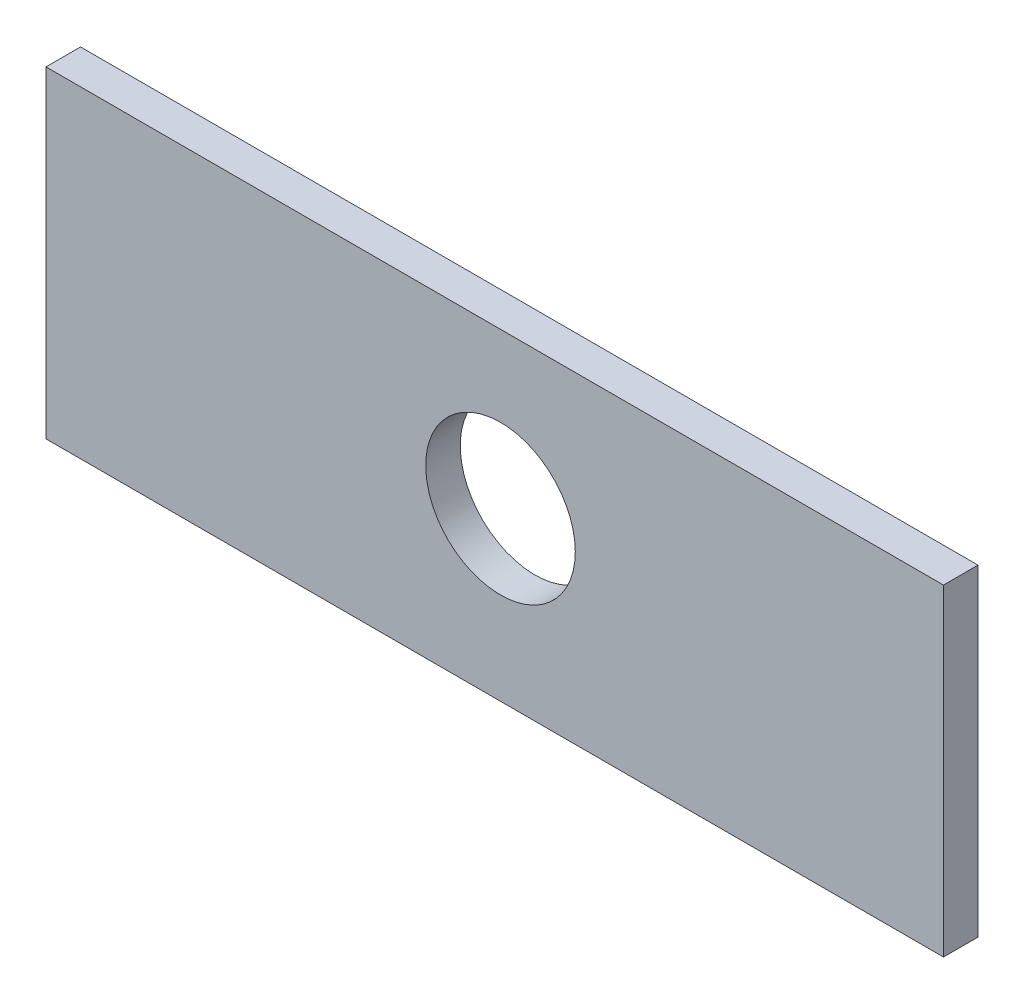
ISO-10303-21;
HEADER;
FILE_DESCRIPTION(('STEP AP214'),'2;1');
FILE_NAME('part.step','',(''),(''),'','','');
FILE_SCHEMA(('AUTOMOTIVE_DESIGN { 1 0 10303 214 1 1 1 1 }'));
ENDSEC;
DATA;
#1=APPLICATION_CONTEXT('core data for automotive mechanical design processes');
#2=APPLICATION_PROTOCOL_DEFINITION('international standard','automotive_design',2000,#1);
#3=PRODUCT_CONTEXT('',#1,'mechanical');
#4=PRODUCT('Part','Part','',(#3));
#5=PRODUCT_RELATED_PRODUCT_CATEGORY('part','',(#4));
#6=PRODUCT_DEFINITION_FORMATION('','',#4);
#7=PRODUCT_DEFINITION_CONTEXT('part definition',#1,'design');
#8=PRODUCT_DEFINITION('design','',#6,#7);
#9=PRODUCT_DEFINITION_SHAPE('','',#8);
#10=(LENGTH_UNIT() NAMED_UNIT(*) SI_UNIT(.MILLI.,.METRE.));
#11=(NAMED_UNIT(*) PLANE_ANGLE_UNIT() SI_UNIT($,.RADIAN.));
#12=(NAMED_UNIT(*) SI_UNIT($,.STERADIAN.) SOLID_ANGLE_UNIT());
#13=UNCERTAINTY_MEASURE_WITH_UNIT(LENGTH_MEASURE(1.E-05),#10,'distance_accuracy_value','');
#14=(GEOMETRIC_REPRESENTATION_CONTEXT(3) GLOBAL_UNCERTAINTY_ASSIGNED_CONTEXT((#13)) GLOBAL_UNIT_ASSIGNED_CONTEXT((#10,
#11,#12)) REPRESENTATION_CONTEXT('',''));
#15=CARTESIAN_POINT('',(0.,0.,0.));
#16=DIRECTION('',(0.,0.,1.));
#17=DIRECTION('',(1.,0.,0.));
#18=AXIS2_PLACEMENT_3D('',#15,#16,#17);
#19=CARTESIAN_POINT('',(0.,0.,1.5));
#20=DIRECTION('',(0.,0.,-1.));
#21=DIRECTION('',(-1.,0.,0.));
#22=AXIS2_PLACEMENT_3D('',#19,#20,#21);
#23=PLANE('',#22);
#24=DIRECTION('',(0.,-1.,0.));
#25=VECTOR('',#24,1.);
#26=CARTESIAN_POINT('',(-44.1929233332503,9.00261513896851,1.5));
#27=LINE('',#26,#25);
#28=CARTESIAN_POINT('',(-44.1929233332503,9.00261513896851,1.5));
#29=VERTEX_POINT('',#28);
#30=CARTESIAN_POINT('',(-44.1929233332503,-18.9973848610315,1.5));
#31=VERTEX_POINT('',#30);
#32=EDGE_CURVE('E90',#29,#31,#27,.T.);
#33=ORIENTED_EDGE('',*,*,#32,.T.);
#34=DIRECTION('',(1.,0.,0.));
#35=VECTOR('',#34,1.);
#36=CARTESIAN_POINT('',(33.8070766667498,-18.9973848610315,1.5));
#37=LINE('',#36,#35);
#38=CARTESIAN_POINT('',(33.8070766667498,-18.9973848610315,1.5));
#39=VERTEX_POINT('',#38);
#40=EDGE_CURVE('E85',#31,#39,#37,.T.);
#41=ORIENTED_EDGE('',*,*,#40,.T.);
#42=DIRECTION('',(0.,1.,0.));
#43=VECTOR('',#42,1.);
#44=CARTESIAN_POINT('',(33.8070766667497,9.00261513896851,1.5));
#45=LINE('',#44,#43);
#46=CARTESIAN_POINT('',(33.8070766667497,9.00261513896851,1.5));
#47=VERTEX_POINT('',#46);
#48=EDGE_CURVE('E88',#39,#47,#45,.T.);
#49=ORIENTED_EDGE('',*,*,#48,.T.);
#50=DIRECTION('',(-1.,0.,0.));
#51=VECTOR('',#50,1.);
#52=CARTESIAN_POINT('',(-44.1929233332503,9.00261513896851,1.5));
#53=LINE('',#52,#51);
#54=EDGE_CURVE('E55',#47,#29,#53,.T.);
#55=ORIENTED_EDGE('',*,*,#54,.T.);
#56=EDGE_LOOP('',(#33,#41,#49,#55));
#57=FACE_BOUND('',#56,.T.);
#58=CARTESIAN_POINT('',(-4.69292333325027,-4.49738486103149,1.5));
#59=DIRECTION('',(0.,0.,1.));
#60=DIRECTION('',(1.,0.,0.));
#61=AXIS2_PLACEMENT_3D('',#58,#59,#60);
#62=CIRCLE('',#61,6.5);
#63=CARTESIAN_POINT('',(1.80707666674973,-4.49738486103149,1.5));
#64=VERTEX_POINT('',#63);
#65=EDGE_CURVE('E105',#64,#64,#62,.T.);
#66=ORIENTED_EDGE('',*,*,#65,.F.);
#67=EDGE_LOOP('',(#66));
#68=FACE_BOUND('',#67,.T.);
#69=ADVANCED_FACE('F38',(#57,#68),#23,.F.);
#70=CARTESIAN_POINT('',(0.,0.,-1.5));
#71=DIRECTION('',(0.,0.,-1.));
#72=DIRECTION('',(-1.,0.,0.));
#73=AXIS2_PLACEMENT_3D('',#70,#71,#72);
#74=PLANE('',#73);
#75=DIRECTION('',(0.,-1.,0.));
#76=VECTOR('',#75,1.);
#77=CARTESIAN_POINT('',(-44.1929233332503,9.00261513896851,-1.5));
#78=LINE('',#77,#76);
#79=CARTESIAN_POINT('',(-44.1929233332503,9.00261513896851,-1.5));
#80=VERTEX_POINT('',#79);
#81=CARTESIAN_POINT('',(-44.1929233332503,-18.9973848610315,-1.5));
#82=VERTEX_POINT('',#81);
#83=EDGE_CURVE('E102',#80,#82,#78,.T.);
#84=ORIENTED_EDGE('',*,*,#83,.F.);
#85=DIRECTION('',(-1.,0.,0.));
#86=VECTOR('',#85,1.);
#87=CARTESIAN_POINT('',(-44.1929233332503,9.00261513896851,-1.5));
#88=LINE('',#87,#86);
#89=CARTESIAN_POINT('',(33.8070766667497,9.00261513896851,-1.5));
#90=VERTEX_POINT('',#89);
#91=EDGE_CURVE('E78',#90,#80,#88,.T.);
#92=ORIENTED_EDGE('',*,*,#91,.F.);
#93=DIRECTION('',(0.,1.,0.));
#94=VECTOR('',#93,1.);
#95=CARTESIAN_POINT('',(33.8070766667497,9.00261513896851,-1.5));
#96=LINE('',#95,#94);
#97=CARTESIAN_POINT('',(33.8070766667498,-18.9973848610315,-1.5));
#98=VERTEX_POINT('',#97);
#99=EDGE_CURVE('E72',#98,#90,#96,.T.);
#100=ORIENTED_EDGE('',*,*,#99,.F.);
#101=DIRECTION('',(1.,0.,0.));
#102=VECTOR('',#101,1.);
#103=CARTESIAN_POINT('',(33.8070766667498,-18.9973848610315,-1.5));
#104=LINE('',#103,#102);
#105=EDGE_CURVE('E94',#82,#98,#104,.T.);
#106=ORIENTED_EDGE('',*,*,#105,.F.);
#107=EDGE_LOOP('',(#84,#92,#100,#106));
#108=FACE_BOUND('',#107,.T.);
#109=CARTESIAN_POINT('',(-4.69292333325027,-4.49738486103149,-1.5));
#110=DIRECTION('',(0.,0.,1.));
#111=DIRECTION('',(1.,0.,0.));
#112=AXIS2_PLACEMENT_3D('',#109,#110,#111);
#113=CIRCLE('',#112,6.5);
#114=CARTESIAN_POINT('',(1.80707666674973,-4.49738486103149,-1.5));
#115=VERTEX_POINT('',#114);
#116=EDGE_CURVE('E117',#115,#115,#113,.T.);
#117=ORIENTED_EDGE('',*,*,#116,.T.);
#118=EDGE_LOOP('',(#117));
#119=FACE_BOUND('',#118,.T.);
#120=ADVANCED_FACE('F113',(#108,#119),#74,.T.);
#121=CARTESIAN_POINT('',(-44.1929233332503,9.00261513896851,1.5));
#122=DIRECTION('',(1.,0.,0.));
#123=DIRECTION('',(0.,0.,-1.));
#124=AXIS2_PLACEMENT_3D('',#121,#122,#123);
#125=PLANE('',#124);
#126=ORIENTED_EDGE('',*,*,#83,.T.);
#127=DIRECTION('',(0.,0.,-1.));
#128=VECTOR('',#127,1.);
#129=CARTESIAN_POINT('',(-44.1929233332503,-18.9973848610315,1.5));
#130=LINE('',#129,#128);
#131=EDGE_CURVE('E11',#31,#82,#130,.T.);
#132=ORIENTED_EDGE('',*,*,#131,.F.);
#133=ORIENTED_EDGE('',*,*,#32,.F.);
#134=DIRECTION('',(0.,0.,-1.));
#135=VECTOR('',#134,1.);
#136=CARTESIAN_POINT('',(-44.1929233332503,9.00261513896851,1.5));
#137=LINE('',#136,#135);
#138=EDGE_CURVE('E98',#29,#80,#137,.T.);
#139=ORIENTED_EDGE('',*,*,#138,.T.);
#140=EDGE_LOOP('',(#126,#132,#133,#139));
#141=FACE_BOUND('',#140,.T.);
#142=ADVANCED_FACE('F40',(#141),#125,.F.);
#143=CARTESIAN_POINT('',(33.8070766667498,-18.9973848610315,1.5));
#144=DIRECTION('',(0.,1.,0.));
#145=DIRECTION('',(-1.,0.,0.));
#146=AXIS2_PLACEMENT_3D('',#143,#144,#145);
#147=PLANE('',#146);
#148=ORIENTED_EDGE('',*,*,#105,.T.);
#149=DIRECTION('',(0.,0.,-1.));
#150=VECTOR('',#149,1.);
#151=CARTESIAN_POINT('',(33.8070766667498,-18.9973848610315,1.5));
#152=LINE('',#151,#150);
#153=EDGE_CURVE('E47',#39,#98,#152,.T.);
#154=ORIENTED_EDGE('',*,*,#153,.F.);
#155=ORIENTED_EDGE('',*,*,#40,.F.);
#156=ORIENTED_EDGE('',*,*,#131,.T.);
#157=EDGE_LOOP('',(#148,#154,#155,#156));
#158=FACE_BOUND('',#157,.T.);
#159=ADVANCED_FACE('F93',(#158),#147,.F.);
#160=CARTESIAN_POINT('',(33.8070766667497,9.00261513896851,1.5));
#161=DIRECTION('',(-1.,0.,0.));
#162=DIRECTION('',(0.,-1.,0.));
#163=AXIS2_PLACEMENT_3D('',#160,#161,#162);
#164=PLANE('',#163);
#165=ORIENTED_EDGE('',*,*,#99,.T.);
#166=DIRECTION('',(0.,0.,-1.));
#167=VECTOR('',#166,1.);
#168=CARTESIAN_POINT('',(33.8070766667497,9.00261513896851,1.5));
#169=LINE('',#168,#167);
#170=EDGE_CURVE('E95',#47,#90,#169,.T.);
#171=ORIENTED_EDGE('',*,*,#170,.F.);
#172=ORIENTED_EDGE('',*,*,#48,.F.);
#173=ORIENTED_EDGE('',*,*,#153,.T.);
#174=EDGE_LOOP('',(#165,#171,#172,#173));
#175=FACE_BOUND('',#174,.T.);
#176=ADVANCED_FACE('F96',(#175),#164,.F.);
#177=CARTESIAN_POINT('',(-44.1929233332503,9.00261513896851,1.5));
#178=DIRECTION('',(0.,-1.,0.));
#179=DIRECTION('',(0.,0.,-1.));
#180=AXIS2_PLACEMENT_3D('',#177,#178,#179);
#181=PLANE('',#180);
#182=ORIENTED_EDGE('',*,*,#91,.T.);
#183=ORIENTED_EDGE('',*,*,#138,.F.);
#184=ORIENTED_EDGE('',*,*,#54,.F.);
#185=ORIENTED_EDGE('',*,*,#170,.T.);
#186=EDGE_LOOP('',(#182,#183,#184,#185));
#187=FACE_BOUND('',#186,.T.);
#188=ADVANCED_FACE('F110',(#187),#181,.F.);
#189=CARTESIAN_POINT('',(-4.69292333325027,-4.49738486103149,1.5));
#190=DIRECTION('',(0.,0.,-1.));
#191=DIRECTION('',(-1.,0.,0.));
#192=AXIS2_PLACEMENT_3D('',#189,#190,#191);
#193=CYLINDRICAL_SURFACE('',#192,6.5);
#194=ORIENTED_EDGE('',*,*,#65,.T.);
#195=EDGE_LOOP('',(#194));
#196=FACE_BOUND('',#195,.T.);
#197=ORIENTED_EDGE('',*,*,#116,.F.);
#198=EDGE_LOOP('',(#197));
#199=FACE_BOUND('',#198,.T.);
#200=ADVANCED_FACE('F123',(#196,#199),#193,.F.);
#201=CLOSED_SHELL('',(#69,#120,#142,#159,#176,#188,#200));
#202=MANIFOLD_SOLID_BREP('B2',#201);
#203=ADVANCED_BREP_SHAPE_REPRESENTATION('',(#18,#202),#14);
#204=SHAPE_DEFINITION_REPRESENTATION(#9,#203);
ENDSEC;
END-ISO-10303-21;
